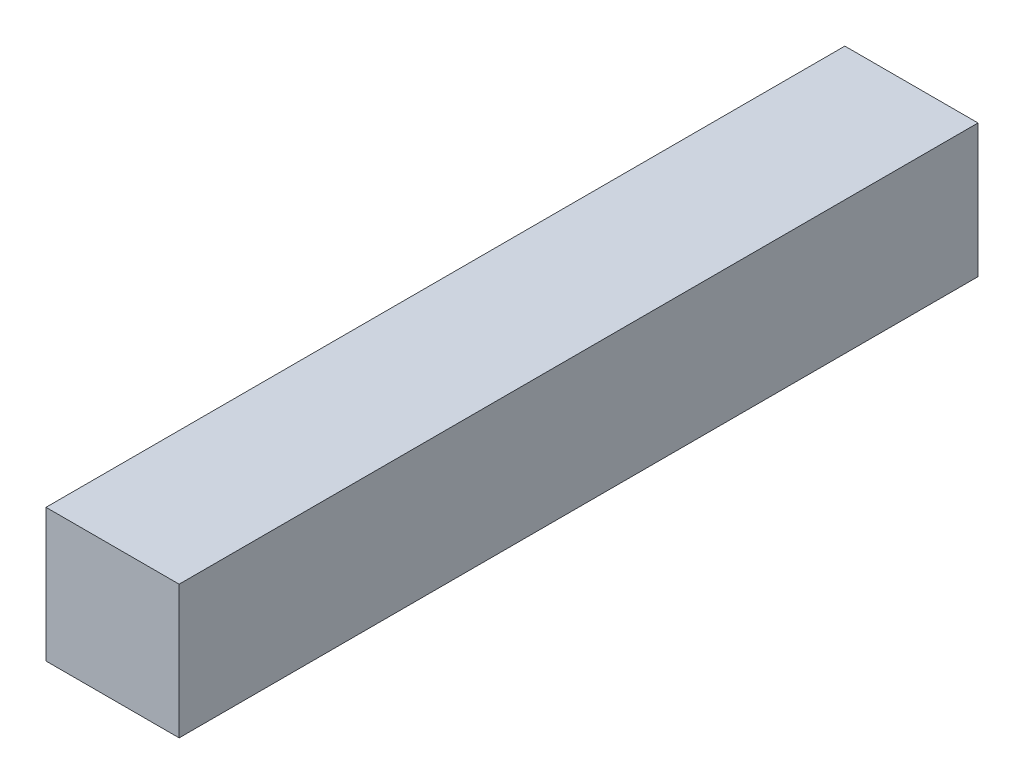
ISO-10303-21;
HEADER;
FILE_DESCRIPTION(('STEP AP214'),'2;1');
FILE_NAME('part.step','',(''),(''),'','','');
FILE_SCHEMA(('AUTOMOTIVE_DESIGN { 1 0 10303 214 1 1 1 1 }'));
ENDSEC;
DATA;
#1=APPLICATION_CONTEXT('core data for automotive mechanical design processes');
#2=APPLICATION_PROTOCOL_DEFINITION('international standard','automotive_design',2000,#1);
#3=PRODUCT_CONTEXT('',#1,'mechanical');
#4=PRODUCT('Part','Part','',(#3));
#5=PRODUCT_RELATED_PRODUCT_CATEGORY('part','',(#4));
#6=PRODUCT_DEFINITION_FORMATION('','',#4);
#7=PRODUCT_DEFINITION_CONTEXT('part definition',#1,'design');
#8=PRODUCT_DEFINITION('design','',#6,#7);
#9=PRODUCT_DEFINITION_SHAPE('','',#8);
#10=(LENGTH_UNIT() NAMED_UNIT(*) SI_UNIT(.MILLI.,.METRE.));
#11=(NAMED_UNIT(*) PLANE_ANGLE_UNIT() SI_UNIT($,.RADIAN.));
#12=(NAMED_UNIT(*) SI_UNIT($,.STERADIAN.) SOLID_ANGLE_UNIT());
#13=UNCERTAINTY_MEASURE_WITH_UNIT(LENGTH_MEASURE(1.E-05),#10,'distance_accuracy_value','');
#14=(GEOMETRIC_REPRESENTATION_CONTEXT(3) GLOBAL_UNCERTAINTY_ASSIGNED_CONTEXT((#13)) GLOBAL_UNIT_ASSIGNED_CONTEXT((#10,
#11,#12)) REPRESENTATION_CONTEXT('',''));
#15=CARTESIAN_POINT('',(0.,0.,0.));
#16=DIRECTION('',(0.,0.,1.));
#17=DIRECTION('',(1.,0.,0.));
#18=AXIS2_PLACEMENT_3D('',#15,#16,#17);
#19=CARTESIAN_POINT('',(1.5,-1.5,9.));
#20=DIRECTION('',(0.,1.,0.));
#21=DIRECTION('',(-1.,0.,0.));
#22=AXIS2_PLACEMENT_3D('',#19,#20,#21);
#23=PLANE('',#22);
#24=DIRECTION('',(0.,0.,-1.));
#25=VECTOR('',#24,1.);
#26=CARTESIAN_POINT('',(-1.5,-1.5,9.));
#27=LINE('',#26,#25);
#28=CARTESIAN_POINT('',(-1.5,-1.5,9.));
#29=VERTEX_POINT('',#28);
#30=CARTESIAN_POINT('',(-1.5,-1.5,-9.));
#31=VERTEX_POINT('',#30);
#32=EDGE_CURVE('E92',#29,#31,#27,.T.);
#33=ORIENTED_EDGE('',*,*,#32,.T.);
#34=DIRECTION('',(1.,0.,0.));
#35=VECTOR('',#34,1.);
#36=CARTESIAN_POINT('',(1.5,-1.5,-9.));
#37=LINE('',#36,#35);
#38=CARTESIAN_POINT('',(1.5,-1.5,-9.));
#39=VERTEX_POINT('',#38);
#40=EDGE_CURVE('E87',#31,#39,#37,.T.);
#41=ORIENTED_EDGE('',*,*,#40,.T.);
#42=DIRECTION('',(0.,0.,-1.));
#43=VECTOR('',#42,1.);
#44=CARTESIAN_POINT('',(1.5,-1.5,9.));
#45=LINE('',#44,#43);
#46=CARTESIAN_POINT('',(1.5,-1.5,9.));
#47=VERTEX_POINT('',#46);
#48=EDGE_CURVE('E11',#47,#39,#45,.T.);
#49=ORIENTED_EDGE('',*,*,#48,.F.);
#50=DIRECTION('',(1.,0.,0.));
#51=VECTOR('',#50,1.);
#52=CARTESIAN_POINT('',(1.5,-1.5,9.));
#53=LINE('',#52,#51);
#54=EDGE_CURVE('E98',#29,#47,#53,.T.);
#55=ORIENTED_EDGE('',*,*,#54,.F.);
#56=EDGE_LOOP('',(#33,#41,#49,#55));
#57=FACE_BOUND('',#56,.T.);
#58=ADVANCED_FACE('F35',(#57),#23,.F.);
#59=CARTESIAN_POINT('',(1.5,-1.5,9.));
#60=DIRECTION('',(-1.,0.,0.));
#61=DIRECTION('',(0.,0.,1.));
#62=AXIS2_PLACEMENT_3D('',#59,#60,#61);
#63=PLANE('',#62);
#64=ORIENTED_EDGE('',*,*,#48,.T.);
#65=DIRECTION('',(0.,1.,0.));
#66=VECTOR('',#65,1.);
#67=CARTESIAN_POINT('',(1.5,-1.5,-9.));
#68=LINE('',#67,#66);
#69=CARTESIAN_POINT('',(1.5,1.5,-9.));
#70=VERTEX_POINT('',#69);
#71=EDGE_CURVE('E77',#39,#70,#68,.T.);
#72=ORIENTED_EDGE('',*,*,#71,.T.);
#73=DIRECTION('',(0.,0.,-1.));
#74=VECTOR('',#73,1.);
#75=CARTESIAN_POINT('',(1.5,1.5,9.));
#76=LINE('',#75,#74);
#77=CARTESIAN_POINT('',(1.5,1.5,9.));
#78=VERTEX_POINT('',#77);
#79=EDGE_CURVE('E42',#78,#70,#76,.T.);
#80=ORIENTED_EDGE('',*,*,#79,.F.);
#81=DIRECTION('',(0.,1.,0.));
#82=VECTOR('',#81,1.);
#83=CARTESIAN_POINT('',(1.5,-1.5,9.));
#84=LINE('',#83,#82);
#85=EDGE_CURVE('E78',#47,#78,#84,.T.);
#86=ORIENTED_EDGE('',*,*,#85,.F.);
#87=EDGE_LOOP('',(#64,#72,#80,#86));
#88=FACE_BOUND('',#87,.T.);
#89=ADVANCED_FACE('F75',(#88),#63,.F.);
#90=CARTESIAN_POINT('',(1.5,1.5,9.));
#91=DIRECTION('',(0.,-1.,0.));
#92=DIRECTION('',(1.,0.,0.));
#93=AXIS2_PLACEMENT_3D('',#90,#91,#92);
#94=PLANE('',#93);
#95=ORIENTED_EDGE('',*,*,#79,.T.);
#96=DIRECTION('',(-1.,0.,0.));
#97=VECTOR('',#96,1.);
#98=CARTESIAN_POINT('',(1.5,1.5,-9.));
#99=LINE('',#98,#97);
#100=CARTESIAN_POINT('',(-1.5,1.5,-9.));
#101=VERTEX_POINT('',#100);
#102=EDGE_CURVE('E90',#70,#101,#99,.T.);
#103=ORIENTED_EDGE('',*,*,#102,.T.);
#104=DIRECTION('',(0.,0.,-1.));
#105=VECTOR('',#104,1.);
#106=CARTESIAN_POINT('',(-1.5,1.5,9.));
#107=LINE('',#106,#105);
#108=CARTESIAN_POINT('',(-1.5,1.5,9.));
#109=VERTEX_POINT('',#108);
#110=EDGE_CURVE('E104',#109,#101,#107,.T.);
#111=ORIENTED_EDGE('',*,*,#110,.F.);
#112=DIRECTION('',(-1.,0.,0.));
#113=VECTOR('',#112,1.);
#114=CARTESIAN_POINT('',(1.5,1.5,9.));
#115=LINE('',#114,#113);
#116=EDGE_CURVE('E54',#78,#109,#115,.T.);
#117=ORIENTED_EDGE('',*,*,#116,.F.);
#118=EDGE_LOOP('',(#95,#103,#111,#117));
#119=FACE_BOUND('',#118,.T.);
#120=ADVANCED_FACE('F106',(#119),#94,.F.);
#121=CARTESIAN_POINT('',(-1.5,-1.5,9.));
#122=DIRECTION('',(1.,0.,0.));
#123=DIRECTION('',(0.,0.,-1.));
#124=AXIS2_PLACEMENT_3D('',#121,#122,#123);
#125=PLANE('',#124);
#126=ORIENTED_EDGE('',*,*,#110,.T.);
#127=DIRECTION('',(0.,-1.,0.));
#128=VECTOR('',#127,1.);
#129=CARTESIAN_POINT('',(-1.5,-1.5,-9.));
#130=LINE('',#129,#128);
#131=EDGE_CURVE('E96',#101,#31,#130,.T.);
#132=ORIENTED_EDGE('',*,*,#131,.T.);
#133=ORIENTED_EDGE('',*,*,#32,.F.);
#134=DIRECTION('',(0.,-1.,0.));
#135=VECTOR('',#134,1.);
#136=CARTESIAN_POINT('',(-1.5,-1.5,9.));
#137=LINE('',#136,#135);
#138=EDGE_CURVE('E49',#109,#29,#137,.T.);
#139=ORIENTED_EDGE('',*,*,#138,.F.);
#140=EDGE_LOOP('',(#126,#132,#133,#139));
#141=FACE_BOUND('',#140,.T.);
#142=ADVANCED_FACE('F108',(#141),#125,.F.);
#143=CARTESIAN_POINT('',(0.,0.,9.));
#144=DIRECTION('',(0.,0.,-1.));
#145=DIRECTION('',(-1.,0.,0.));
#146=AXIS2_PLACEMENT_3D('',#143,#144,#145);
#147=PLANE('',#146);
#148=ORIENTED_EDGE('',*,*,#54,.T.);
#149=ORIENTED_EDGE('',*,*,#85,.T.);
#150=ORIENTED_EDGE('',*,*,#116,.T.);
#151=ORIENTED_EDGE('',*,*,#138,.T.);
#152=EDGE_LOOP('',(#148,#149,#150,#151));
#153=FACE_BOUND('',#152,.T.);
#154=ADVANCED_FACE('F109',(#153),#147,.F.);
#155=CARTESIAN_POINT('',(0.,0.,-9.));
#156=DIRECTION('',(0.,0.,-1.));
#157=DIRECTION('',(-1.,0.,0.));
#158=AXIS2_PLACEMENT_3D('',#155,#156,#157);
#159=PLANE('',#158);
#160=ORIENTED_EDGE('',*,*,#40,.F.);
#161=ORIENTED_EDGE('',*,*,#131,.F.);
#162=ORIENTED_EDGE('',*,*,#102,.F.);
#163=ORIENTED_EDGE('',*,*,#71,.F.);
#164=EDGE_LOOP('',(#160,#161,#162,#163));
#165=FACE_BOUND('',#164,.T.);
#166=ADVANCED_FACE('F85',(#165),#159,.T.);
#167=CLOSED_SHELL('',(#58,#89,#120,#142,#154,#166));
#168=MANIFOLD_SOLID_BREP('B2',#167);
#169=ADVANCED_BREP_SHAPE_REPRESENTATION('',(#18,#168),#14);
#170=SHAPE_DEFINITION_REPRESENTATION(#9,#169);
ENDSEC;
END-ISO-10303-21;
